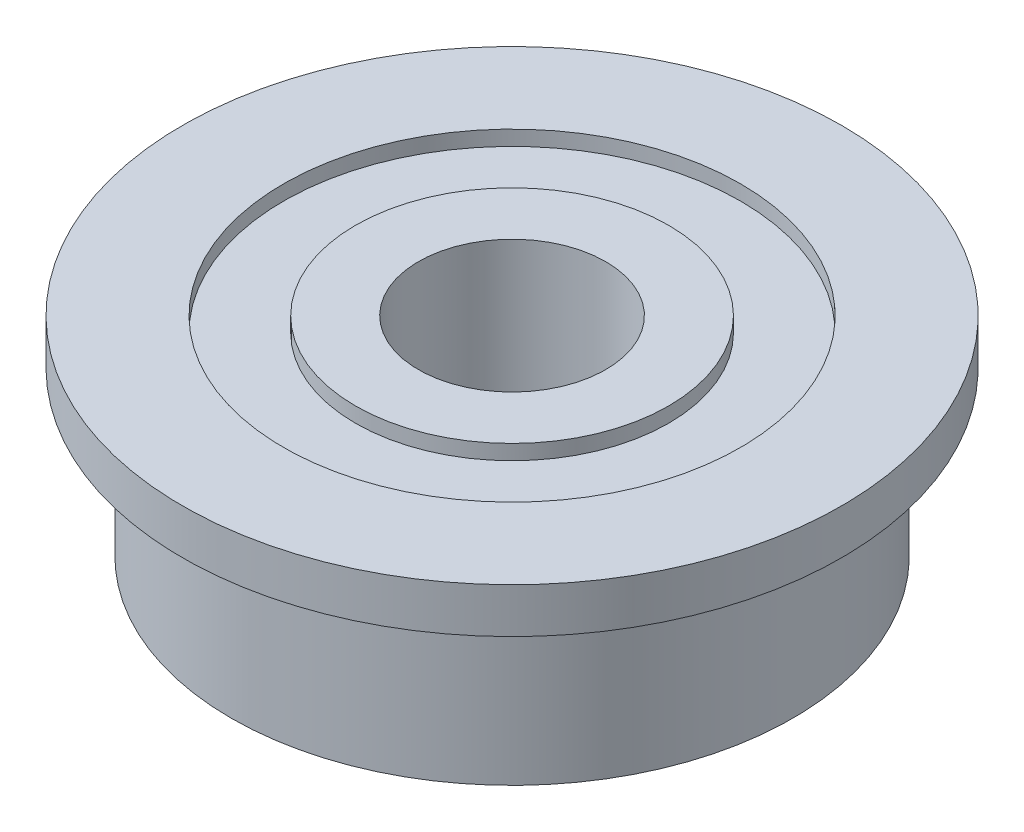
ISO-10303-21;
HEADER;
FILE_DESCRIPTION(('STEP AP214'),'2;1');
FILE_NAME('part.step','',(''),(''),'','','');
FILE_SCHEMA(('AUTOMOTIVE_DESIGN { 1 0 10303 214 1 1 1 1 }'));
ENDSEC;
DATA;
#1=APPLICATION_CONTEXT('core data for automotive mechanical design processes');
#2=APPLICATION_PROTOCOL_DEFINITION('international standard','automotive_design',2000,#1);
#3=PRODUCT_CONTEXT('',#1,'mechanical');
#4=PRODUCT('Part','Part','',(#3));
#5=PRODUCT_RELATED_PRODUCT_CATEGORY('part','',(#4));
#6=PRODUCT_DEFINITION_FORMATION('','',#4);
#7=PRODUCT_DEFINITION_CONTEXT('part definition',#1,'design');
#8=PRODUCT_DEFINITION('design','',#6,#7);
#9=PRODUCT_DEFINITION_SHAPE('','',#8);
#10=(LENGTH_UNIT() NAMED_UNIT(*) SI_UNIT(.MILLI.,.METRE.));
#11=(NAMED_UNIT(*) PLANE_ANGLE_UNIT() SI_UNIT($,.RADIAN.));
#12=(NAMED_UNIT(*) SI_UNIT($,.STERADIAN.) SOLID_ANGLE_UNIT());
#13=UNCERTAINTY_MEASURE_WITH_UNIT(LENGTH_MEASURE(1.E-05),#10,'distance_accuracy_value','');
#14=(GEOMETRIC_REPRESENTATION_CONTEXT(3) GLOBAL_UNCERTAINTY_ASSIGNED_CONTEXT((#13)) GLOBAL_UNIT_ASSIGNED_CONTEXT((#10,
#11,#12)) REPRESENTATION_CONTEXT('',''));
#15=CARTESIAN_POINT('',(0.,0.,0.));
#16=DIRECTION('',(0.,0.,1.));
#17=DIRECTION('',(1.,0.,0.));
#18=AXIS2_PLACEMENT_3D('',#15,#16,#17);
#19=CARTESIAN_POINT('',(1.5875,0.,0.));
#20=DIRECTION('',(0.,-1.,0.));
#21=DIRECTION('',(0.,0.,-1.));
#22=AXIS2_PLACEMENT_3D('',#19,#20,#21);
#23=PLANE('',#22);
#24=CARTESIAN_POINT('',(0.,0.,0.));
#25=DIRECTION('',(0.,-1.,0.));
#26=DIRECTION('',(0.,0.,-1.));
#27=AXIS2_PLACEMENT_3D('',#24,#25,#26);
#28=CIRCLE('',#27,2.6543);
#29=CARTESIAN_POINT('',(0.,0.,-2.6543));
#30=VERTEX_POINT('',#29);
#31=EDGE_CURVE('E10',#30,#30,#28,.T.);
#32=ORIENTED_EDGE('',*,*,#31,.T.);
#33=EDGE_LOOP('',(#32));
#34=FACE_BOUND('',#33,.T.);
#35=CARTESIAN_POINT('',(0.,0.,0.));
#36=DIRECTION('',(0.,-1.,0.));
#37=DIRECTION('',(0.,0.,-1.));
#38=AXIS2_PLACEMENT_3D('',#35,#36,#37);
#39=CIRCLE('',#38,1.5875);
#40=CARTESIAN_POINT('',(0.,0.,-1.5875));
#41=VERTEX_POINT('',#40);
#42=EDGE_CURVE('E77',#41,#41,#39,.T.);
#43=ORIENTED_EDGE('',*,*,#42,.F.);
#44=EDGE_LOOP('',(#43));
#45=FACE_BOUND('',#44,.T.);
#46=ADVANCED_FACE('F31',(#34,#45),#23,.T.);
#47=CARTESIAN_POINT('',(0.,3.5306,0.));
#48=DIRECTION('',(0.,-1.,0.));
#49=DIRECTION('',(0.,0.,-1.));
#50=AXIS2_PLACEMENT_3D('',#47,#48,#49);
#51=CYLINDRICAL_SURFACE('',#50,2.6543);
#52=CARTESIAN_POINT('',(0.,0.254,0.));
#53=DIRECTION('',(0.,-1.,0.));
#54=DIRECTION('',(0.,0.,-1.));
#55=AXIS2_PLACEMENT_3D('',#52,#53,#54);
#56=CIRCLE('',#55,2.6543);
#57=CARTESIAN_POINT('',(0.,0.254,-2.6543));
#58=VERTEX_POINT('',#57);
#59=EDGE_CURVE('E37',#58,#58,#56,.T.);
#60=ORIENTED_EDGE('',*,*,#59,.T.);
#61=EDGE_LOOP('',(#60));
#62=FACE_BOUND('',#61,.T.);
#63=ORIENTED_EDGE('',*,*,#31,.F.);
#64=EDGE_LOOP('',(#63));
#65=FACE_BOUND('',#64,.T.);
#66=ADVANCED_FACE('F85',(#62,#65),#51,.T.);
#67=CARTESIAN_POINT('',(2.6543,0.254,0.));
#68=DIRECTION('',(0.,-1.,0.));
#69=DIRECTION('',(0.,0.,-1.));
#70=AXIS2_PLACEMENT_3D('',#67,#68,#69);
#71=PLANE('',#70);
#72=CARTESIAN_POINT('',(0.,0.254,0.));
#73=DIRECTION('',(0.,-1.,0.));
#74=DIRECTION('',(0.,0.,-1.));
#75=AXIS2_PLACEMENT_3D('',#72,#73,#74);
#76=CIRCLE('',#75,3.8735);
#77=CARTESIAN_POINT('',(0.,0.254,-3.8735));
#78=VERTEX_POINT('',#77);
#79=EDGE_CURVE('E41',#78,#78,#76,.T.);
#80=ORIENTED_EDGE('',*,*,#79,.T.);
#81=EDGE_LOOP('',(#80));
#82=FACE_BOUND('',#81,.T.);
#83=ORIENTED_EDGE('',*,*,#59,.F.);
#84=EDGE_LOOP('',(#83));
#85=FACE_BOUND('',#84,.T.);
#86=ADVANCED_FACE('F89',(#82,#85),#71,.T.);
#87=CARTESIAN_POINT('',(0.,3.5306,0.));
#88=DIRECTION('',(0.,-1.,0.));
#89=DIRECTION('',(0.,0.,-1.));
#90=AXIS2_PLACEMENT_3D('',#87,#88,#89);
#91=CYLINDRICAL_SURFACE('',#90,3.8735);
#92=CARTESIAN_POINT('',(0.,0.,0.));
#93=DIRECTION('',(0.,-1.,0.));
#94=DIRECTION('',(0.,0.,-1.));
#95=AXIS2_PLACEMENT_3D('',#92,#93,#94);
#96=CIRCLE('',#95,3.8735);
#97=CARTESIAN_POINT('',(0.,0.,-3.8735));
#98=VERTEX_POINT('',#97);
#99=EDGE_CURVE('E45',#98,#98,#96,.T.);
#100=ORIENTED_EDGE('',*,*,#99,.T.);
#101=EDGE_LOOP('',(#100));
#102=FACE_BOUND('',#101,.T.);
#103=ORIENTED_EDGE('',*,*,#79,.F.);
#104=EDGE_LOOP('',(#103));
#105=FACE_BOUND('',#104,.T.);
#106=ADVANCED_FACE('F93',(#102,#105),#91,.F.);
#107=CARTESIAN_POINT('',(3.8735,0.,0.));
#108=DIRECTION('',(0.,-1.,0.));
#109=DIRECTION('',(0.,0.,-1.));
#110=AXIS2_PLACEMENT_3D('',#107,#108,#109);
#111=PLANE('',#110);
#112=CARTESIAN_POINT('',(0.,0.,0.));
#113=DIRECTION('',(0.,-1.,0.));
#114=DIRECTION('',(0.,0.,-1.));
#115=AXIS2_PLACEMENT_3D('',#112,#113,#114);
#116=CIRCLE('',#115,4.7625);
#117=CARTESIAN_POINT('',(0.,0.,-4.7625));
#118=VERTEX_POINT('',#117);
#119=EDGE_CURVE('E50',#118,#118,#116,.T.);
#120=ORIENTED_EDGE('',*,*,#119,.T.);
#121=EDGE_LOOP('',(#120));
#122=FACE_BOUND('',#121,.T.);
#123=ORIENTED_EDGE('',*,*,#99,.F.);
#124=EDGE_LOOP('',(#123));
#125=FACE_BOUND('',#124,.T.);
#126=ADVANCED_FACE('F100',(#122,#125),#111,.T.);
#127=CARTESIAN_POINT('',(0.,3.5306,0.));
#128=DIRECTION('',(0.,-1.,0.));
#129=DIRECTION('',(0.,0.,-1.));
#130=AXIS2_PLACEMENT_3D('',#127,#128,#129);
#131=CYLINDRICAL_SURFACE('',#130,4.7625);
#132=CARTESIAN_POINT('',(0.,2.7686,0.));
#133=DIRECTION('',(0.,-1.,0.));
#134=DIRECTION('',(0.,0.,-1.));
#135=AXIS2_PLACEMENT_3D('',#132,#133,#134);
#136=CIRCLE('',#135,4.7625);
#137=CARTESIAN_POINT('',(0.,2.7686,-4.7625));
#138=VERTEX_POINT('',#137);
#139=EDGE_CURVE('E53',#138,#138,#136,.T.);
#140=ORIENTED_EDGE('',*,*,#139,.T.);
#141=EDGE_LOOP('',(#140));
#142=FACE_BOUND('',#141,.T.);
#143=ORIENTED_EDGE('',*,*,#119,.F.);
#144=EDGE_LOOP('',(#143));
#145=FACE_BOUND('',#144,.T.);
#146=ADVANCED_FACE('F104',(#142,#145),#131,.T.);
#147=CARTESIAN_POINT('',(4.7625,2.7686,0.));
#148=DIRECTION('',(0.,-1.,0.));
#149=DIRECTION('',(0.,0.,-1.));
#150=AXIS2_PLACEMENT_3D('',#147,#148,#149);
#151=PLANE('',#150);
#152=CARTESIAN_POINT('',(0.,2.7686,0.));
#153=DIRECTION('',(0.,-1.,0.));
#154=DIRECTION('',(0.,0.,-1.));
#155=AXIS2_PLACEMENT_3D('',#152,#153,#154);
#156=CIRCLE('',#155,5.588);
#157=CARTESIAN_POINT('',(0.,2.7686,-5.588));
#158=VERTEX_POINT('',#157);
#159=EDGE_CURVE('E56',#158,#158,#156,.T.);
#160=ORIENTED_EDGE('',*,*,#159,.T.);
#161=EDGE_LOOP('',(#160));
#162=FACE_BOUND('',#161,.T.);
#163=ORIENTED_EDGE('',*,*,#139,.F.);
#164=EDGE_LOOP('',(#163));
#165=FACE_BOUND('',#164,.T.);
#166=ADVANCED_FACE('F108',(#162,#165),#151,.T.);
#167=CARTESIAN_POINT('',(0.,3.5306,0.));
#168=DIRECTION('',(0.,-1.,0.));
#169=DIRECTION('',(0.,0.,-1.));
#170=AXIS2_PLACEMENT_3D('',#167,#168,#169);
#171=CYLINDRICAL_SURFACE('',#170,5.588);
#172=CARTESIAN_POINT('',(0.,3.5306,0.));
#173=DIRECTION('',(0.,-1.,0.));
#174=DIRECTION('',(0.,0.,-1.));
#175=AXIS2_PLACEMENT_3D('',#172,#173,#174);
#176=CIRCLE('',#175,5.588);
#177=CARTESIAN_POINT('',(0.,3.5306,-5.588));
#178=VERTEX_POINT('',#177);
#179=EDGE_CURVE('E59',#178,#178,#176,.T.);
#180=ORIENTED_EDGE('',*,*,#179,.T.);
#181=EDGE_LOOP('',(#180));
#182=FACE_BOUND('',#181,.T.);
#183=ORIENTED_EDGE('',*,*,#159,.F.);
#184=EDGE_LOOP('',(#183));
#185=FACE_BOUND('',#184,.T.);
#186=ADVANCED_FACE('F112',(#182,#185),#171,.T.);
#187=CARTESIAN_POINT('',(5.588,3.5306,0.));
#188=DIRECTION('',(0.,1.,0.));
#189=DIRECTION('',(0.,0.,1.));
#190=AXIS2_PLACEMENT_3D('',#187,#188,#189);
#191=PLANE('',#190);
#192=CARTESIAN_POINT('',(0.,3.5306,0.));
#193=DIRECTION('',(0.,-1.,0.));
#194=DIRECTION('',(0.,0.,-1.));
#195=AXIS2_PLACEMENT_3D('',#192,#193,#194);
#196=CIRCLE('',#195,3.8735);
#197=CARTESIAN_POINT('',(0.,3.5306,-3.8735));
#198=VERTEX_POINT('',#197);
#199=EDGE_CURVE('E62',#198,#198,#196,.T.);
#200=ORIENTED_EDGE('',*,*,#199,.T.);
#201=EDGE_LOOP('',(#200));
#202=FACE_BOUND('',#201,.T.);
#203=ORIENTED_EDGE('',*,*,#179,.F.);
#204=EDGE_LOOP('',(#203));
#205=FACE_BOUND('',#204,.T.);
#206=ADVANCED_FACE('F116',(#202,#205),#191,.T.);
#207=CARTESIAN_POINT('',(0.,3.5306,0.));
#208=DIRECTION('',(0.,-1.,0.));
#209=DIRECTION('',(0.,0.,-1.));
#210=AXIS2_PLACEMENT_3D('',#207,#208,#209);
#211=CYLINDRICAL_SURFACE('',#210,3.8735);
#212=CARTESIAN_POINT('',(0.,3.2766,0.));
#213=DIRECTION('',(0.,-1.,0.));
#214=DIRECTION('',(0.,0.,-1.));
#215=AXIS2_PLACEMENT_3D('',#212,#213,#214);
#216=CIRCLE('',#215,3.8735);
#217=CARTESIAN_POINT('',(0.,3.2766,-3.8735));
#218=VERTEX_POINT('',#217);
#219=EDGE_CURVE('E65',#218,#218,#216,.T.);
#220=ORIENTED_EDGE('',*,*,#219,.T.);
#221=EDGE_LOOP('',(#220));
#222=FACE_BOUND('',#221,.T.);
#223=ORIENTED_EDGE('',*,*,#199,.F.);
#224=EDGE_LOOP('',(#223));
#225=FACE_BOUND('',#224,.T.);
#226=ADVANCED_FACE('F120',(#222,#225),#211,.F.);
#227=CARTESIAN_POINT('',(3.8735,3.2766,0.));
#228=DIRECTION('',(0.,1.,0.));
#229=DIRECTION('',(0.,0.,1.));
#230=AXIS2_PLACEMENT_3D('',#227,#228,#229);
#231=PLANE('',#230);
#232=CARTESIAN_POINT('',(0.,3.2766,0.));
#233=DIRECTION('',(0.,-1.,0.));
#234=DIRECTION('',(0.,0.,-1.));
#235=AXIS2_PLACEMENT_3D('',#232,#233,#234);
#236=CIRCLE('',#235,2.6543);
#237=CARTESIAN_POINT('',(0.,3.2766,-2.6543));
#238=VERTEX_POINT('',#237);
#239=EDGE_CURVE('E68',#238,#238,#236,.T.);
#240=ORIENTED_EDGE('',*,*,#239,.T.);
#241=EDGE_LOOP('',(#240));
#242=FACE_BOUND('',#241,.T.);
#243=ORIENTED_EDGE('',*,*,#219,.F.);
#244=EDGE_LOOP('',(#243));
#245=FACE_BOUND('',#244,.T.);
#246=ADVANCED_FACE('F124',(#242,#245),#231,.T.);
#247=CARTESIAN_POINT('',(0.,3.5306,0.));
#248=DIRECTION('',(0.,-1.,0.));
#249=DIRECTION('',(0.,0.,-1.));
#250=AXIS2_PLACEMENT_3D('',#247,#248,#249);
#251=CYLINDRICAL_SURFACE('',#250,2.6543);
#252=CARTESIAN_POINT('',(0.,3.5306,0.));
#253=DIRECTION('',(0.,-1.,0.));
#254=DIRECTION('',(0.,0.,-1.));
#255=AXIS2_PLACEMENT_3D('',#252,#253,#254);
#256=CIRCLE('',#255,2.6543);
#257=CARTESIAN_POINT('',(0.,3.5306,-2.6543));
#258=VERTEX_POINT('',#257);
#259=EDGE_CURVE('E71',#258,#258,#256,.T.);
#260=ORIENTED_EDGE('',*,*,#259,.T.);
#261=EDGE_LOOP('',(#260));
#262=FACE_BOUND('',#261,.T.);
#263=ORIENTED_EDGE('',*,*,#239,.F.);
#264=EDGE_LOOP('',(#263));
#265=FACE_BOUND('',#264,.T.);
#266=ADVANCED_FACE('F128',(#262,#265),#251,.T.);
#267=CARTESIAN_POINT('',(2.6543,3.5306,0.));
#268=DIRECTION('',(0.,1.,0.));
#269=DIRECTION('',(0.,0.,1.));
#270=AXIS2_PLACEMENT_3D('',#267,#268,#269);
#271=PLANE('',#270);
#272=CARTESIAN_POINT('',(0.,3.5306,0.));
#273=DIRECTION('',(0.,-1.,0.));
#274=DIRECTION('',(0.,0.,-1.));
#275=AXIS2_PLACEMENT_3D('',#272,#273,#274);
#276=CIRCLE('',#275,1.5875);
#277=CARTESIAN_POINT('',(0.,3.5306,-1.5875));
#278=VERTEX_POINT('',#277);
#279=EDGE_CURVE('E74',#278,#278,#276,.T.);
#280=ORIENTED_EDGE('',*,*,#279,.T.);
#281=EDGE_LOOP('',(#280));
#282=FACE_BOUND('',#281,.T.);
#283=ORIENTED_EDGE('',*,*,#259,.F.);
#284=EDGE_LOOP('',(#283));
#285=FACE_BOUND('',#284,.T.);
#286=ADVANCED_FACE('F132',(#282,#285),#271,.T.);
#287=CARTESIAN_POINT('',(0.,3.5306,0.));
#288=DIRECTION('',(0.,-1.,0.));
#289=DIRECTION('',(0.,0.,-1.));
#290=AXIS2_PLACEMENT_3D('',#287,#288,#289);
#291=CYLINDRICAL_SURFACE('',#290,1.5875);
#292=ORIENTED_EDGE('',*,*,#42,.T.);
#293=EDGE_LOOP('',(#292));
#294=FACE_BOUND('',#293,.T.);
#295=ORIENTED_EDGE('',*,*,#279,.F.);
#296=EDGE_LOOP('',(#295));
#297=FACE_BOUND('',#296,.T.);
#298=ADVANCED_FACE('F81',(#294,#297),#291,.F.);
#299=CLOSED_SHELL('',(#46,#66,#86,#106,#126,#146,#166,#186,#206,#226,#246,#266,#286,#298));
#300=MANIFOLD_SOLID_BREP('B2',#299);
#301=ADVANCED_BREP_SHAPE_REPRESENTATION('',(#18,#300),#14);
#302=SHAPE_DEFINITION_REPRESENTATION(#9,#301);
ENDSEC;
END-ISO-10303-21;
